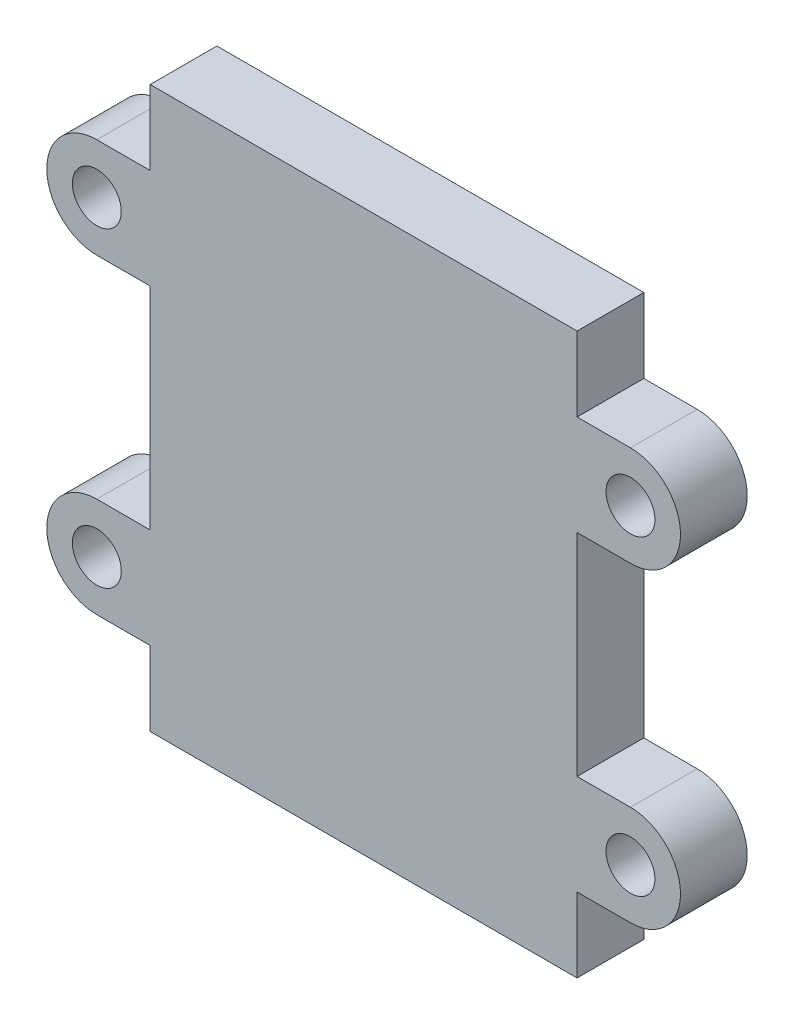
ISO-10303-21;
HEADER;
FILE_DESCRIPTION(('STEP AP214'),'2;1');
FILE_NAME('part.step','',(''),(''),'','','');
FILE_SCHEMA(('AUTOMOTIVE_DESIGN { 1 0 10303 214 1 1 1 1 }'));
ENDSEC;
DATA;
#1=APPLICATION_CONTEXT('core data for automotive mechanical design processes');
#2=APPLICATION_PROTOCOL_DEFINITION('international standard','automotive_design',2000,#1);
#3=PRODUCT_CONTEXT('',#1,'mechanical');
#4=PRODUCT('Part','Part','',(#3));
#5=PRODUCT_RELATED_PRODUCT_CATEGORY('part','',(#4));
#6=PRODUCT_DEFINITION_FORMATION('','',#4);
#7=PRODUCT_DEFINITION_CONTEXT('part definition',#1,'design');
#8=PRODUCT_DEFINITION('design','',#6,#7);
#9=PRODUCT_DEFINITION_SHAPE('','',#8);
#10=(LENGTH_UNIT() NAMED_UNIT(*) SI_UNIT(.MILLI.,.METRE.));
#11=(NAMED_UNIT(*) PLANE_ANGLE_UNIT() SI_UNIT($,.RADIAN.));
#12=(NAMED_UNIT(*) SI_UNIT($,.STERADIAN.) SOLID_ANGLE_UNIT());
#13=UNCERTAINTY_MEASURE_WITH_UNIT(LENGTH_MEASURE(1.E-05),#10,'distance_accuracy_value','');
#14=(GEOMETRIC_REPRESENTATION_CONTEXT(3) GLOBAL_UNCERTAINTY_ASSIGNED_CONTEXT((#13)) GLOBAL_UNIT_ASSIGNED_CONTEXT((#10,
#11,#12)) REPRESENTATION_CONTEXT('',''));
#15=CARTESIAN_POINT('',(0.,0.,0.));
#16=DIRECTION('',(0.,0.,1.));
#17=DIRECTION('',(1.,0.,0.));
#18=AXIS2_PLACEMENT_3D('',#15,#16,#17);
#19=CARTESIAN_POINT('',(-9.6,-12.6,3.));
#20=DIRECTION('',(1.,0.,0.));
#21=DIRECTION('',(0.,0.,-1.));
#22=AXIS2_PLACEMENT_3D('',#19,#20,#21);
#23=PLANE('',#22);
#24=DIRECTION('',(0.,-1.,0.));
#25=VECTOR('',#24,1.);
#26=CARTESIAN_POINT('',(-9.6,-12.6,0.));
#27=LINE('',#26,#25);
#28=CARTESIAN_POINT('',(-9.6,12.6,0.));
#29=VERTEX_POINT('',#28);
#30=CARTESIAN_POINT('',(-9.6,9.25,0.));
#31=VERTEX_POINT('',#30);
#32=EDGE_CURVE('E205',#29,#31,#27,.T.);
#33=ORIENTED_EDGE('',*,*,#32,.T.);
#34=DIRECTION('',(0.,0.,1.));
#35=VECTOR('',#34,1.);
#36=CARTESIAN_POINT('',(-9.6,9.25,0.));
#37=LINE('',#36,#35);
#38=CARTESIAN_POINT('',(-9.6,9.25,3.));
#39=VERTEX_POINT('',#38);
#40=EDGE_CURVE('E339',#31,#39,#37,.T.);
#41=ORIENTED_EDGE('',*,*,#40,.T.);
#42=DIRECTION('',(0.,-1.,0.));
#43=VECTOR('',#42,1.);
#44=CARTESIAN_POINT('',(-9.6,-12.6,3.));
#45=LINE('',#44,#43);
#46=CARTESIAN_POINT('',(-9.6,12.6,3.));
#47=VERTEX_POINT('',#46);
#48=EDGE_CURVE('E232',#47,#39,#45,.T.);
#49=ORIENTED_EDGE('',*,*,#48,.F.);
#50=DIRECTION('',(0.,0.,-1.));
#51=VECTOR('',#50,1.);
#52=CARTESIAN_POINT('',(-9.6,12.6,3.));
#53=LINE('',#52,#51);
#54=EDGE_CURVE('E448',#47,#29,#53,.T.);
#55=ORIENTED_EDGE('',*,*,#54,.T.);
#56=EDGE_LOOP('',(#33,#41,#49,#55));
#57=FACE_BOUND('',#56,.T.);
#58=ADVANCED_FACE('F37',(#57),#23,.F.);
#59=DIRECTION('',(0.,0.,1.));
#60=VECTOR('',#59,1.);
#61=CARTESIAN_POINT('',(-9.6,-9.25,0.));
#62=LINE('',#61,#60);
#63=CARTESIAN_POINT('',(-9.6,-9.25,0.));
#64=VERTEX_POINT('',#63);
#65=CARTESIAN_POINT('',(-9.6,-9.25,3.));
#66=VERTEX_POINT('',#65);
#67=EDGE_CURVE('E313',#64,#66,#62,.T.);
#68=ORIENTED_EDGE('',*,*,#67,.F.);
#69=CARTESIAN_POINT('',(-9.6,-12.6,0.));
#70=VERTEX_POINT('',#69);
#71=EDGE_CURVE('E208',#64,#70,#27,.T.);
#72=ORIENTED_EDGE('',*,*,#71,.T.);
#73=DIRECTION('',(0.,0.,-1.));
#74=VECTOR('',#73,1.);
#75=CARTESIAN_POINT('',(-9.6,-12.6,3.));
#76=LINE('',#75,#74);
#77=CARTESIAN_POINT('',(-9.6,-12.6,3.));
#78=VERTEX_POINT('',#77);
#79=EDGE_CURVE('E235',#78,#70,#76,.T.);
#80=ORIENTED_EDGE('',*,*,#79,.F.);
#81=EDGE_CURVE('E236',#66,#78,#45,.T.);
#82=ORIENTED_EDGE('',*,*,#81,.F.);
#83=EDGE_LOOP('',(#68,#72,#80,#82));
#84=FACE_BOUND('',#83,.T.);
#85=ADVANCED_FACE('F399',(#84),#23,.F.);
#86=CARTESIAN_POINT('',(9.6,-12.6,3.));
#87=DIRECTION('',(-1.,0.,0.));
#88=DIRECTION('',(0.,0.,1.));
#89=AXIS2_PLACEMENT_3D('',#86,#87,#88);
#90=PLANE('',#89);
#91=DIRECTION('',(0.,1.,0.));
#92=VECTOR('',#91,1.);
#93=CARTESIAN_POINT('',(9.6,-12.6,0.));
#94=LINE('',#93,#92);
#95=CARTESIAN_POINT('',(9.6,-12.6,0.));
#96=VERTEX_POINT('',#95);
#97=CARTESIAN_POINT('',(9.6,-9.25,0.));
#98=VERTEX_POINT('',#97);
#99=EDGE_CURVE('E218',#96,#98,#94,.T.);
#100=ORIENTED_EDGE('',*,*,#99,.T.);
#101=DIRECTION('',(0.,0.,1.));
#102=VECTOR('',#101,1.);
#103=CARTESIAN_POINT('',(9.6,-9.25,0.));
#104=LINE('',#103,#102);
#105=CARTESIAN_POINT('',(9.6,-9.25,3.));
#106=VERTEX_POINT('',#105);
#107=EDGE_CURVE('E275',#98,#106,#104,.T.);
#108=ORIENTED_EDGE('',*,*,#107,.T.);
#109=DIRECTION('',(0.,1.,0.));
#110=VECTOR('',#109,1.);
#111=CARTESIAN_POINT('',(9.6,-12.6,3.));
#112=LINE('',#111,#110);
#113=CARTESIAN_POINT('',(9.6,-12.6,3.));
#114=VERTEX_POINT('',#113);
#115=EDGE_CURVE('E239',#114,#106,#112,.T.);
#116=ORIENTED_EDGE('',*,*,#115,.F.);
#117=DIRECTION('',(0.,0.,-1.));
#118=VECTOR('',#117,1.);
#119=CARTESIAN_POINT('',(9.6,-12.6,3.));
#120=LINE('',#119,#118);
#121=EDGE_CURVE('E447',#114,#96,#120,.T.);
#122=ORIENTED_EDGE('',*,*,#121,.T.);
#123=EDGE_LOOP('',(#100,#108,#116,#122));
#124=FACE_BOUND('',#123,.T.);
#125=ADVANCED_FACE('F404',(#124),#90,.F.);
#126=DIRECTION('',(0.,0.,1.));
#127=VECTOR('',#126,1.);
#128=CARTESIAN_POINT('',(9.6,9.25,0.));
#129=LINE('',#128,#127);
#130=CARTESIAN_POINT('',(9.6,9.25,0.));
#131=VERTEX_POINT('',#130);
#132=CARTESIAN_POINT('',(9.6,9.25,3.));
#133=VERTEX_POINT('',#132);
#134=EDGE_CURVE('E248',#131,#133,#129,.T.);
#135=ORIENTED_EDGE('',*,*,#134,.F.);
#136=CARTESIAN_POINT('',(9.6,12.6,0.));
#137=VERTEX_POINT('',#136);
#138=EDGE_CURVE('E226',#131,#137,#94,.T.);
#139=ORIENTED_EDGE('',*,*,#138,.T.);
#140=DIRECTION('',(0.,0.,-1.));
#141=VECTOR('',#140,1.);
#142=CARTESIAN_POINT('',(9.6,12.6,3.));
#143=LINE('',#142,#141);
#144=CARTESIAN_POINT('',(9.6,12.6,3.));
#145=VERTEX_POINT('',#144);
#146=EDGE_CURVE('E446',#145,#137,#143,.T.);
#147=ORIENTED_EDGE('',*,*,#146,.F.);
#148=EDGE_CURVE('E243',#133,#145,#112,.T.);
#149=ORIENTED_EDGE('',*,*,#148,.F.);
#150=EDGE_LOOP('',(#135,#139,#147,#149));
#151=FACE_BOUND('',#150,.T.);
#152=ADVANCED_FACE('F416',(#151),#90,.F.);
#153=CARTESIAN_POINT('',(-9.6,-12.6,3.));
#154=DIRECTION('',(0.,1.,0.));
#155=DIRECTION('',(0.,0.,1.));
#156=AXIS2_PLACEMENT_3D('',#153,#154,#155);
#157=PLANE('',#156);
#158=DIRECTION('',(1.,0.,0.));
#159=VECTOR('',#158,1.);
#160=CARTESIAN_POINT('',(-9.6,-12.6,0.));
#161=LINE('',#160,#159);
#162=EDGE_CURVE('E228',#70,#96,#161,.T.);
#163=ORIENTED_EDGE('',*,*,#162,.T.);
#164=ORIENTED_EDGE('',*,*,#121,.F.);
#165=DIRECTION('',(1.,0.,0.));
#166=VECTOR('',#165,1.);
#167=CARTESIAN_POINT('',(-9.6,-12.6,3.));
#168=LINE('',#167,#166);
#169=EDGE_CURVE('E209',#78,#114,#168,.T.);
#170=ORIENTED_EDGE('',*,*,#169,.F.);
#171=ORIENTED_EDGE('',*,*,#79,.T.);
#172=EDGE_LOOP('',(#163,#164,#170,#171));
#173=FACE_BOUND('',#172,.T.);
#174=ADVANCED_FACE('F39',(#173),#157,.F.);
#175=CARTESIAN_POINT('',(9.6,-4.75,3.));
#176=VERTEX_POINT('',#175);
#177=CARTESIAN_POINT('',(9.6,4.75,3.));
#178=VERTEX_POINT('',#177);
#179=EDGE_CURVE('E242',#176,#178,#112,.T.);
#180=ORIENTED_EDGE('',*,*,#179,.F.);
#181=DIRECTION('',(0.,0.,1.));
#182=VECTOR('',#181,1.);
#183=CARTESIAN_POINT('',(9.6,-4.75,0.));
#184=LINE('',#183,#182);
#185=CARTESIAN_POINT('',(9.6,-4.75,0.));
#186=VERTEX_POINT('',#185);
#187=EDGE_CURVE('E283',#186,#176,#184,.T.);
#188=ORIENTED_EDGE('',*,*,#187,.F.);
#189=CARTESIAN_POINT('',(9.6,4.75,0.));
#190=VERTEX_POINT('',#189);
#191=EDGE_CURVE('E224',#186,#190,#94,.T.);
#192=ORIENTED_EDGE('',*,*,#191,.T.);
#193=DIRECTION('',(0.,0.,1.));
#194=VECTOR('',#193,1.);
#195=CARTESIAN_POINT('',(9.6,4.75,0.));
#196=LINE('',#195,#194);
#197=EDGE_CURVE('E251',#190,#178,#196,.T.);
#198=ORIENTED_EDGE('',*,*,#197,.T.);
#199=EDGE_LOOP('',(#180,#188,#192,#198));
#200=FACE_BOUND('',#199,.T.);
#201=ADVANCED_FACE('F411',(#200),#90,.F.);
#202=CARTESIAN_POINT('',(-9.6,12.6,3.));
#203=DIRECTION('',(0.,-1.,0.));
#204=DIRECTION('',(1.,0.,0.));
#205=AXIS2_PLACEMENT_3D('',#202,#203,#204);
#206=PLANE('',#205);
#207=DIRECTION('',(-1.,0.,0.));
#208=VECTOR('',#207,1.);
#209=CARTESIAN_POINT('',(-9.6,12.6,0.));
#210=LINE('',#209,#208);
#211=EDGE_CURVE('E212',#137,#29,#210,.T.);
#212=ORIENTED_EDGE('',*,*,#211,.T.);
#213=ORIENTED_EDGE('',*,*,#54,.F.);
#214=DIRECTION('',(-1.,0.,0.));
#215=VECTOR('',#214,1.);
#216=CARTESIAN_POINT('',(-9.6,12.6,3.));
#217=LINE('',#216,#215);
#218=EDGE_CURVE('E237',#145,#47,#217,.T.);
#219=ORIENTED_EDGE('',*,*,#218,.F.);
#220=ORIENTED_EDGE('',*,*,#146,.T.);
#221=EDGE_LOOP('',(#212,#213,#219,#220));
#222=FACE_BOUND('',#221,.T.);
#223=ADVANCED_FACE('F407',(#222),#206,.F.);
#224=CARTESIAN_POINT('',(-9.6,4.75,0.));
#225=VERTEX_POINT('',#224);
#226=CARTESIAN_POINT('',(-9.6,1.15,0.));
#227=VERTEX_POINT('',#226);
#228=EDGE_CURVE('E200',#225,#227,#27,.T.);
#229=ORIENTED_EDGE('',*,*,#228,.T.);
#230=CARTESIAN_POINT('',(-9.6,0.,0.));
#231=DIRECTION('',(-1.,0.,0.));
#232=DIRECTION('',(0.,0.,1.));
#233=AXIS2_PLACEMENT_3D('',#230,#231,#232);
#234=CIRCLE('',#233,1.15);
#235=CARTESIAN_POINT('',(-9.6,-1.15,0.));
#236=VERTEX_POINT('',#235);
#237=EDGE_CURVE('E186',#236,#227,#234,.T.);
#238=ORIENTED_EDGE('',*,*,#237,.F.);
#239=CARTESIAN_POINT('',(-9.6,-4.75,0.));
#240=VERTEX_POINT('',#239);
#241=EDGE_CURVE('E206',#236,#240,#27,.T.);
#242=ORIENTED_EDGE('',*,*,#241,.T.);
#243=DIRECTION('',(0.,0.,1.));
#244=VECTOR('',#243,1.);
#245=CARTESIAN_POINT('',(-9.6,-4.75,0.));
#246=LINE('',#245,#244);
#247=CARTESIAN_POINT('',(-9.6,-4.75,3.));
#248=VERTEX_POINT('',#247);
#249=EDGE_CURVE('E316',#240,#248,#246,.T.);
#250=ORIENTED_EDGE('',*,*,#249,.T.);
#251=CARTESIAN_POINT('',(-9.6,4.75,3.));
#252=VERTEX_POINT('',#251);
#253=EDGE_CURVE('E59',#252,#248,#45,.T.);
#254=ORIENTED_EDGE('',*,*,#253,.F.);
#255=DIRECTION('',(0.,0.,1.));
#256=VECTOR('',#255,1.);
#257=CARTESIAN_POINT('',(-9.6,4.75,0.));
#258=LINE('',#257,#256);
#259=EDGE_CURVE('E203',#225,#252,#258,.T.);
#260=ORIENTED_EDGE('',*,*,#259,.F.);
#261=EDGE_LOOP('',(#229,#238,#242,#250,#254,#260));
#262=FACE_BOUND('',#261,.T.);
#263=ADVANCED_FACE('F202',(#262),#23,.F.);
#264=CARTESIAN_POINT('',(0.,0.,3.));
#265=DIRECTION('',(0.,0.,1.));
#266=DIRECTION('',(1.,0.,0.));
#267=AXIS2_PLACEMENT_3D('',#264,#265,#266);
#268=PLANE('',#267);
#269=DIRECTION('',(1.,0.,0.));
#270=VECTOR('',#269,1.);
#271=CARTESIAN_POINT('',(-12.,-9.25,3.));
#272=LINE('',#271,#270);
#273=CARTESIAN_POINT('',(-12.,-9.25,3.));
#274=VERTEX_POINT('',#273);
#275=EDGE_CURVE('E323',#274,#66,#272,.T.);
#276=ORIENTED_EDGE('',*,*,#275,.T.);
#277=ORIENTED_EDGE('',*,*,#81,.T.);
#278=ORIENTED_EDGE('',*,*,#169,.T.);
#279=ORIENTED_EDGE('',*,*,#115,.T.);
#280=DIRECTION('',(1.,0.,0.));
#281=VECTOR('',#280,1.);
#282=CARTESIAN_POINT('',(12.,-9.25,3.));
#283=LINE('',#282,#281);
#284=CARTESIAN_POINT('',(12.,-9.25,3.));
#285=VERTEX_POINT('',#284);
#286=EDGE_CURVE('E294',#106,#285,#283,.T.);
#287=ORIENTED_EDGE('',*,*,#286,.T.);
#288=CARTESIAN_POINT('',(12.,-7.,3.));
#289=DIRECTION('',(0.,0.,1.));
#290=DIRECTION('',(1.,0.,0.));
#291=AXIS2_PLACEMENT_3D('',#288,#289,#290);
#292=CIRCLE('',#291,2.25);
#293=CARTESIAN_POINT('',(12.,-4.75,3.));
#294=VERTEX_POINT('',#293);
#295=EDGE_CURVE('E291',#285,#294,#292,.T.);
#296=ORIENTED_EDGE('',*,*,#295,.T.);
#297=DIRECTION('',(-1.,0.,0.));
#298=VECTOR('',#297,1.);
#299=CARTESIAN_POINT('',(9.6,-4.75,3.));
#300=LINE('',#299,#298);
#301=EDGE_CURVE('E287',#294,#176,#300,.T.);
#302=ORIENTED_EDGE('',*,*,#301,.T.);
#303=ORIENTED_EDGE('',*,*,#179,.T.);
#304=DIRECTION('',(1.,0.,0.));
#305=VECTOR('',#304,1.);
#306=CARTESIAN_POINT('',(9.6,4.75,3.));
#307=LINE('',#306,#305);
#308=CARTESIAN_POINT('',(12.,4.75,3.));
#309=VERTEX_POINT('',#308);
#310=EDGE_CURVE('E255',#178,#309,#307,.T.);
#311=ORIENTED_EDGE('',*,*,#310,.T.);
#312=CARTESIAN_POINT('',(12.,7.,3.));
#313=DIRECTION('',(0.,0.,1.));
#314=DIRECTION('',(-1.,0.,0.));
#315=AXIS2_PLACEMENT_3D('',#312,#313,#314);
#316=CIRCLE('',#315,2.25);
#317=CARTESIAN_POINT('',(12.,9.25,3.));
#318=VERTEX_POINT('',#317);
#319=EDGE_CURVE('E262',#309,#318,#316,.T.);
#320=ORIENTED_EDGE('',*,*,#319,.T.);
#321=DIRECTION('',(-1.,0.,0.));
#322=VECTOR('',#321,1.);
#323=CARTESIAN_POINT('',(12.,9.25,3.));
#324=LINE('',#323,#322);
#325=EDGE_CURVE('E259',#318,#133,#324,.T.);
#326=ORIENTED_EDGE('',*,*,#325,.T.);
#327=ORIENTED_EDGE('',*,*,#148,.T.);
#328=ORIENTED_EDGE('',*,*,#218,.T.);
#329=ORIENTED_EDGE('',*,*,#48,.T.);
#330=DIRECTION('',(-1.,0.,0.));
#331=VECTOR('',#330,1.);
#332=CARTESIAN_POINT('',(-12.,9.25,3.));
#333=LINE('',#332,#331);
#334=CARTESIAN_POINT('',(-12.,9.25,3.));
#335=VERTEX_POINT('',#334);
#336=EDGE_CURVE('E356',#39,#335,#333,.T.);
#337=ORIENTED_EDGE('',*,*,#336,.T.);
#338=CARTESIAN_POINT('',(-12.,7.,3.));
#339=DIRECTION('',(0.,0.,1.));
#340=DIRECTION('',(1.,0.,0.));
#341=AXIS2_PLACEMENT_3D('',#338,#339,#340);
#342=CIRCLE('',#341,2.25);
#343=CARTESIAN_POINT('',(-12.,4.75,3.));
#344=VERTEX_POINT('',#343);
#345=EDGE_CURVE('E353',#335,#344,#342,.T.);
#346=ORIENTED_EDGE('',*,*,#345,.T.);
#347=DIRECTION('',(1.,0.,0.));
#348=VECTOR('',#347,1.);
#349=CARTESIAN_POINT('',(-9.6,4.75,3.));
#350=LINE('',#349,#348);
#351=EDGE_CURVE('E349',#344,#252,#350,.T.);
#352=ORIENTED_EDGE('',*,*,#351,.T.);
#353=ORIENTED_EDGE('',*,*,#253,.T.);
#354=DIRECTION('',(-1.,0.,0.));
#355=VECTOR('',#354,1.);
#356=CARTESIAN_POINT('',(-9.6,-4.75,3.));
#357=LINE('',#356,#355);
#358=CARTESIAN_POINT('',(-12.,-4.75,3.));
#359=VERTEX_POINT('',#358);
#360=EDGE_CURVE('E319',#248,#359,#357,.T.);
#361=ORIENTED_EDGE('',*,*,#360,.T.);
#362=CARTESIAN_POINT('',(-12.,-7.,3.));
#363=DIRECTION('',(0.,0.,1.));
#364=DIRECTION('',(-1.,0.,0.));
#365=AXIS2_PLACEMENT_3D('',#362,#363,#364);
#366=CIRCLE('',#365,2.25);
#367=EDGE_CURVE('E326',#359,#274,#366,.T.);
#368=ORIENTED_EDGE('',*,*,#367,.T.);
#369=EDGE_LOOP('',(#276,#277,#278,#279,#287,#296,#302,#303,#311,#320,#326,#327,#328,#329,#337,
#346,#352,#353,#361,#368));
#370=FACE_BOUND('',#369,.T.);
#371=CARTESIAN_POINT('',(-12.,-7.,3.));
#372=DIRECTION('',(0.,0.,1.));
#373=DIRECTION('',(1.,0.,0.));
#374=AXIS2_PLACEMENT_3D('',#371,#372,#373);
#375=CIRCLE('',#374,1.1);
#376=CARTESIAN_POINT('',(-10.9,-7.,3.));
#377=VERTEX_POINT('',#376);
#378=EDGE_CURVE('E336',#377,#377,#375,.T.);
#379=ORIENTED_EDGE('',*,*,#378,.F.);
#380=EDGE_LOOP('',(#379));
#381=FACE_BOUND('',#380,.T.);
#382=CARTESIAN_POINT('',(12.,7.,3.));
#383=DIRECTION('',(0.,0.,1.));
#384=DIRECTION('',(1.,0.,0.));
#385=AXIS2_PLACEMENT_3D('',#382,#383,#384);
#386=CIRCLE('',#385,1.1);
#387=CARTESIAN_POINT('',(13.1,7.,3.));
#388=VERTEX_POINT('',#387);
#389=EDGE_CURVE('E272',#388,#388,#386,.T.);
#390=ORIENTED_EDGE('',*,*,#389,.F.);
#391=EDGE_LOOP('',(#390));
#392=FACE_BOUND('',#391,.T.);
#393=CARTESIAN_POINT('',(12.,-7.,3.));
#394=DIRECTION('',(0.,0.,1.));
#395=DIRECTION('',(-1.,0.,0.));
#396=AXIS2_PLACEMENT_3D('',#393,#394,#395);
#397=CIRCLE('',#396,1.1);
#398=CARTESIAN_POINT('',(10.9,-7.,3.));
#399=VERTEX_POINT('',#398);
#400=EDGE_CURVE('E305',#399,#399,#397,.T.);
#401=ORIENTED_EDGE('',*,*,#400,.F.);
#402=EDGE_LOOP('',(#401));
#403=FACE_BOUND('',#402,.T.);
#404=CARTESIAN_POINT('',(-12.,7.,3.));
#405=DIRECTION('',(0.,0.,1.));
#406=DIRECTION('',(-1.,0.,0.));
#407=AXIS2_PLACEMENT_3D('',#404,#405,#406);
#408=CIRCLE('',#407,1.1);
#409=CARTESIAN_POINT('',(-13.1,7.,3.));
#410=VERTEX_POINT('',#409);
#411=EDGE_CURVE('E366',#410,#410,#408,.T.);
#412=ORIENTED_EDGE('',*,*,#411,.F.);
#413=EDGE_LOOP('',(#412));
#414=FACE_BOUND('',#413,.T.);
#415=ADVANCED_FACE('F386',(#370,#381,#392,#403,#414),#268,.T.);
#416=CARTESIAN_POINT('',(0.,0.,0.));
#417=DIRECTION('',(0.,0.,1.));
#418=DIRECTION('',(1.,0.,0.));
#419=AXIS2_PLACEMENT_3D('',#416,#417,#418);
#420=PLANE('',#419);
#421=CARTESIAN_POINT('',(0.,0.,0.));
#422=DIRECTION('',(0.,0.,1.));
#423=DIRECTION('',(1.,0.,0.));
#424=AXIS2_PLACEMENT_3D('',#421,#422,#423);
#425=CIRCLE('',#424,2.5);
#426=CARTESIAN_POINT('',(2.5,0.,0.));
#427=VERTEX_POINT('',#426);
#428=EDGE_CURVE('E11',#427,#427,#425,.F.);
#429=ORIENTED_EDGE('',*,*,#428,.F.);
#430=EDGE_LOOP('',(#429));
#431=FACE_BOUND('',#430,.T.);
#432=DIRECTION('',(0.,-1.,0.));
#433=VECTOR('',#432,1.);
#434=CARTESIAN_POINT('',(-2.6,0.,0.));
#435=LINE('',#434,#433);
#436=CARTESIAN_POINT('',(-2.6,1.15,0.));
#437=VERTEX_POINT('',#436);
#438=CARTESIAN_POINT('',(-2.6,-1.15,0.));
#439=VERTEX_POINT('',#438);
#440=EDGE_CURVE('E201',#437,#439,#435,.T.);
#441=ORIENTED_EDGE('',*,*,#440,.F.);
#442=DIRECTION('',(-1.,0.,0.));
#443=VECTOR('',#442,1.);
#444=CARTESIAN_POINT('',(-2.6,1.15,0.));
#445=LINE('',#444,#443);
#446=EDGE_CURVE('E45',#437,#227,#445,.T.);
#447=ORIENTED_EDGE('',*,*,#446,.T.);
#448=ORIENTED_EDGE('',*,*,#228,.F.);
#449=DIRECTION('',(1.,0.,0.));
#450=VECTOR('',#449,1.);
#451=CARTESIAN_POINT('',(-9.6,4.75,0.));
#452=LINE('',#451,#450);
#453=CARTESIAN_POINT('',(-12.,4.75,0.));
#454=VERTEX_POINT('',#453);
#455=EDGE_CURVE('E345',#454,#225,#452,.T.);
#456=ORIENTED_EDGE('',*,*,#455,.F.);
#457=CARTESIAN_POINT('',(-12.,7.,0.));
#458=DIRECTION('',(0.,0.,1.));
#459=DIRECTION('',(1.,0.,0.));
#460=AXIS2_PLACEMENT_3D('',#457,#458,#459);
#461=CIRCLE('',#460,2.25);
#462=CARTESIAN_POINT('',(-12.,9.25,0.));
#463=VERTEX_POINT('',#462);
#464=EDGE_CURVE('E361',#463,#454,#461,.T.);
#465=ORIENTED_EDGE('',*,*,#464,.F.);
#466=DIRECTION('',(-1.,0.,0.));
#467=VECTOR('',#466,1.);
#468=CARTESIAN_POINT('',(-12.,9.25,0.));
#469=LINE('',#468,#467);
#470=EDGE_CURVE('E352',#31,#463,#469,.T.);
#471=ORIENTED_EDGE('',*,*,#470,.F.);
#472=ORIENTED_EDGE('',*,*,#32,.F.);
#473=ORIENTED_EDGE('',*,*,#211,.F.);
#474=ORIENTED_EDGE('',*,*,#138,.F.);
#475=DIRECTION('',(-1.,0.,0.));
#476=VECTOR('',#475,1.);
#477=CARTESIAN_POINT('',(12.,9.25,0.));
#478=LINE('',#477,#476);
#479=CARTESIAN_POINT('',(12.,9.25,0.));
#480=VERTEX_POINT('',#479);
#481=EDGE_CURVE('E268',#480,#131,#478,.T.);
#482=ORIENTED_EDGE('',*,*,#481,.F.);
#483=CARTESIAN_POINT('',(12.,7.,0.));
#484=DIRECTION('',(0.,0.,1.));
#485=DIRECTION('',(-1.,0.,0.));
#486=AXIS2_PLACEMENT_3D('',#483,#484,#485);
#487=CIRCLE('',#486,2.25);
#488=CARTESIAN_POINT('',(12.,4.75,0.));
#489=VERTEX_POINT('',#488);
#490=EDGE_CURVE('E258',#489,#480,#487,.T.);
#491=ORIENTED_EDGE('',*,*,#490,.F.);
#492=DIRECTION('',(1.,0.,0.));
#493=VECTOR('',#492,1.);
#494=CARTESIAN_POINT('',(9.6,4.75,0.));
#495=LINE('',#494,#493);
#496=EDGE_CURVE('E249',#190,#489,#495,.T.);
#497=ORIENTED_EDGE('',*,*,#496,.F.);
#498=ORIENTED_EDGE('',*,*,#191,.F.);
#499=DIRECTION('',(-1.,0.,0.));
#500=VECTOR('',#499,1.);
#501=CARTESIAN_POINT('',(9.6,-4.75,0.));
#502=LINE('',#501,#500);
#503=CARTESIAN_POINT('',(12.,-4.75,0.));
#504=VERTEX_POINT('',#503);
#505=EDGE_CURVE('E281',#504,#186,#502,.T.);
#506=ORIENTED_EDGE('',*,*,#505,.F.);
#507=CARTESIAN_POINT('',(12.,-7.,0.));
#508=DIRECTION('',(0.,0.,1.));
#509=DIRECTION('',(1.,0.,0.));
#510=AXIS2_PLACEMENT_3D('',#507,#508,#509);
#511=CIRCLE('',#510,2.25);
#512=CARTESIAN_POINT('',(12.,-9.25,0.));
#513=VERTEX_POINT('',#512);
#514=EDGE_CURVE('E300',#513,#504,#511,.T.);
#515=ORIENTED_EDGE('',*,*,#514,.F.);
#516=DIRECTION('',(1.,0.,0.));
#517=VECTOR('',#516,1.);
#518=CARTESIAN_POINT('',(12.,-9.25,0.));
#519=LINE('',#518,#517);
#520=EDGE_CURVE('E290',#98,#513,#519,.T.);
#521=ORIENTED_EDGE('',*,*,#520,.F.);
#522=ORIENTED_EDGE('',*,*,#99,.F.);
#523=ORIENTED_EDGE('',*,*,#162,.F.);
#524=ORIENTED_EDGE('',*,*,#71,.F.);
#525=DIRECTION('',(1.,0.,0.));
#526=VECTOR('',#525,1.);
#527=CARTESIAN_POINT('',(-12.,-9.25,0.));
#528=LINE('',#527,#526);
#529=CARTESIAN_POINT('',(-12.,-9.25,0.));
#530=VERTEX_POINT('',#529);
#531=EDGE_CURVE('E332',#530,#64,#528,.T.);
#532=ORIENTED_EDGE('',*,*,#531,.F.);
#533=CARTESIAN_POINT('',(-12.,-7.,0.));
#534=DIRECTION('',(0.,0.,1.));
#535=DIRECTION('',(-1.,0.,0.));
#536=AXIS2_PLACEMENT_3D('',#533,#534,#535);
#537=CIRCLE('',#536,2.25);
#538=CARTESIAN_POINT('',(-12.,-4.75,0.));
#539=VERTEX_POINT('',#538);
#540=EDGE_CURVE('E322',#539,#530,#537,.T.);
#541=ORIENTED_EDGE('',*,*,#540,.F.);
#542=DIRECTION('',(-1.,0.,0.));
#543=VECTOR('',#542,1.);
#544=CARTESIAN_POINT('',(-9.6,-4.75,0.));
#545=LINE('',#544,#543);
#546=EDGE_CURVE('E314',#240,#539,#545,.T.);
#547=ORIENTED_EDGE('',*,*,#546,.F.);
#548=ORIENTED_EDGE('',*,*,#241,.F.);
#549=DIRECTION('',(-1.,0.,0.));
#550=VECTOR('',#549,1.);
#551=CARTESIAN_POINT('',(-2.6,-1.15,0.));
#552=LINE('',#551,#550);
#553=EDGE_CURVE('E191',#236,#439,#552,.F.);
#554=ORIENTED_EDGE('',*,*,#553,.T.);
#555=EDGE_LOOP('',(#441,#447,#448,#456,#465,#471,#472,#473,#474,#482,#491,#497,#498,#506,#515,
#521,#522,#523,#524,#532,#541,#547,#548,#554));
#556=FACE_BOUND('',#555,.T.);
#557=CARTESIAN_POINT('',(-12.,-7.,0.));
#558=DIRECTION('',(0.,0.,1.));
#559=DIRECTION('',(1.,0.,0.));
#560=AXIS2_PLACEMENT_3D('',#557,#558,#559);
#561=CIRCLE('',#560,1.1);
#562=CARTESIAN_POINT('',(-10.9,-7.,0.));
#563=VERTEX_POINT('',#562);
#564=EDGE_CURVE('E329',#563,#563,#561,.T.);
#565=ORIENTED_EDGE('',*,*,#564,.T.);
#566=EDGE_LOOP('',(#565));
#567=FACE_BOUND('',#566,.T.);
#568=CARTESIAN_POINT('',(12.,7.,0.));
#569=DIRECTION('',(0.,0.,1.));
#570=DIRECTION('',(1.,0.,0.));
#571=AXIS2_PLACEMENT_3D('',#568,#569,#570);
#572=CIRCLE('',#571,1.1);
#573=CARTESIAN_POINT('',(13.1,7.,0.));
#574=VERTEX_POINT('',#573);
#575=EDGE_CURVE('E265',#574,#574,#572,.T.);
#576=ORIENTED_EDGE('',*,*,#575,.T.);
#577=EDGE_LOOP('',(#576));
#578=FACE_BOUND('',#577,.T.);
#579=CARTESIAN_POINT('',(12.,-7.,0.));
#580=DIRECTION('',(0.,0.,1.));
#581=DIRECTION('',(-1.,0.,0.));
#582=AXIS2_PLACEMENT_3D('',#579,#580,#581);
#583=CIRCLE('',#582,1.1);
#584=CARTESIAN_POINT('',(10.9,-7.,0.));
#585=VERTEX_POINT('',#584);
#586=EDGE_CURVE('E297',#585,#585,#583,.T.);
#587=ORIENTED_EDGE('',*,*,#586,.T.);
#588=EDGE_LOOP('',(#587));
#589=FACE_BOUND('',#588,.T.);
#590=CARTESIAN_POINT('',(-12.,7.,0.));
#591=DIRECTION('',(0.,0.,1.));
#592=DIRECTION('',(-1.,0.,0.));
#593=AXIS2_PLACEMENT_3D('',#590,#591,#592);
#594=CIRCLE('',#593,1.1);
#595=CARTESIAN_POINT('',(-13.1,7.,0.));
#596=VERTEX_POINT('',#595);
#597=EDGE_CURVE('E359',#596,#596,#594,.T.);
#598=ORIENTED_EDGE('',*,*,#597,.T.);
#599=EDGE_LOOP('',(#598));
#600=FACE_BOUND('',#599,.T.);
#601=ADVANCED_FACE('F197',(#431,#556,#567,#578,#589,#600),#420,.F.);
#602=CARTESIAN_POINT('',(12.,7.,0.));
#603=DIRECTION('',(0.,0.,1.));
#604=DIRECTION('',(1.,0.,0.));
#605=AXIS2_PLACEMENT_3D('',#602,#603,#604);
#606=CYLINDRICAL_SURFACE('',#605,2.25);
#607=ORIENTED_EDGE('',*,*,#319,.F.);
#608=DIRECTION('',(0.,0.,1.));
#609=VECTOR('',#608,1.);
#610=CARTESIAN_POINT('',(12.,4.75,0.));
#611=LINE('',#610,#609);
#612=EDGE_CURVE('E231',#489,#309,#611,.T.);
#613=ORIENTED_EDGE('',*,*,#612,.F.);
#614=ORIENTED_EDGE('',*,*,#490,.T.);
#615=DIRECTION('',(0.,0.,1.));
#616=VECTOR('',#615,1.);
#617=CARTESIAN_POINT('',(12.,9.25,0.));
#618=LINE('',#617,#616);
#619=EDGE_CURVE('E246',#480,#318,#618,.T.);
#620=ORIENTED_EDGE('',*,*,#619,.T.);
#621=EDGE_LOOP('',(#607,#613,#614,#620));
#622=FACE_BOUND('',#621,.T.);
#623=ADVANCED_FACE('F385',(#622),#606,.T.);
#624=CARTESIAN_POINT('',(9.6,4.75,0.));
#625=DIRECTION('',(0.,-1.,0.));
#626=DIRECTION('',(0.,0.,-1.));
#627=AXIS2_PLACEMENT_3D('',#624,#625,#626);
#628=PLANE('',#627);
#629=ORIENTED_EDGE('',*,*,#310,.F.);
#630=ORIENTED_EDGE('',*,*,#197,.F.);
#631=ORIENTED_EDGE('',*,*,#496,.T.);
#632=ORIENTED_EDGE('',*,*,#612,.T.);
#633=EDGE_LOOP('',(#629,#630,#631,#632));
#634=FACE_BOUND('',#633,.T.);
#635=ADVANCED_FACE('F392',(#634),#628,.T.);
#636=CARTESIAN_POINT('',(12.,9.25,0.));
#637=DIRECTION('',(0.,1.,0.));
#638=DIRECTION('',(0.,0.,1.));
#639=AXIS2_PLACEMENT_3D('',#636,#637,#638);
#640=PLANE('',#639);
#641=ORIENTED_EDGE('',*,*,#325,.F.);
#642=ORIENTED_EDGE('',*,*,#619,.F.);
#643=ORIENTED_EDGE('',*,*,#481,.T.);
#644=ORIENTED_EDGE('',*,*,#134,.T.);
#645=EDGE_LOOP('',(#641,#642,#643,#644));
#646=FACE_BOUND('',#645,.T.);
#647=ADVANCED_FACE('F512',(#646),#640,.T.);
#648=CARTESIAN_POINT('',(12.,7.,0.));
#649=DIRECTION('',(0.,0.,1.));
#650=DIRECTION('',(1.,0.,0.));
#651=AXIS2_PLACEMENT_3D('',#648,#649,#650);
#652=CYLINDRICAL_SURFACE('',#651,1.1);
#653=ORIENTED_EDGE('',*,*,#575,.F.);
#654=EDGE_LOOP('',(#653));
#655=FACE_BOUND('',#654,.T.);
#656=ORIENTED_EDGE('',*,*,#389,.T.);
#657=EDGE_LOOP('',(#656));
#658=FACE_BOUND('',#657,.T.);
#659=ADVANCED_FACE('F508',(#655,#658),#652,.F.);
#660=CARTESIAN_POINT('',(12.,-9.25,0.));
#661=DIRECTION('',(0.,-1.,0.));
#662=DIRECTION('',(0.,0.,-1.));
#663=AXIS2_PLACEMENT_3D('',#660,#661,#662);
#664=PLANE('',#663);
#665=ORIENTED_EDGE('',*,*,#286,.F.);
#666=ORIENTED_EDGE('',*,*,#107,.F.);
#667=ORIENTED_EDGE('',*,*,#520,.T.);
#668=DIRECTION('',(0.,0.,1.));
#669=VECTOR('',#668,1.);
#670=CARTESIAN_POINT('',(12.,-9.25,0.));
#671=LINE('',#670,#669);
#672=EDGE_CURVE('E278',#513,#285,#671,.T.);
#673=ORIENTED_EDGE('',*,*,#672,.T.);
#674=EDGE_LOOP('',(#665,#666,#667,#673));
#675=FACE_BOUND('',#674,.T.);
#676=ADVANCED_FACE('F501',(#675),#664,.T.);
#677=CARTESIAN_POINT('',(9.6,-4.75,0.));
#678=DIRECTION('',(0.,1.,0.));
#679=DIRECTION('',(0.,0.,1.));
#680=AXIS2_PLACEMENT_3D('',#677,#678,#679);
#681=PLANE('',#680);
#682=ORIENTED_EDGE('',*,*,#301,.F.);
#683=DIRECTION('',(0.,0.,1.));
#684=VECTOR('',#683,1.);
#685=CARTESIAN_POINT('',(12.,-4.75,0.));
#686=LINE('',#685,#684);
#687=EDGE_CURVE('E280',#504,#294,#686,.T.);
#688=ORIENTED_EDGE('',*,*,#687,.F.);
#689=ORIENTED_EDGE('',*,*,#505,.T.);
#690=ORIENTED_EDGE('',*,*,#187,.T.);
#691=EDGE_LOOP('',(#682,#688,#689,#690));
#692=FACE_BOUND('',#691,.T.);
#693=ADVANCED_FACE('F498',(#692),#681,.T.);
#694=CARTESIAN_POINT('',(12.,-7.,0.));
#695=DIRECTION('',(0.,0.,1.));
#696=DIRECTION('',(1.,0.,0.));
#697=AXIS2_PLACEMENT_3D('',#694,#695,#696);
#698=CYLINDRICAL_SURFACE('',#697,2.25);
#699=ORIENTED_EDGE('',*,*,#295,.F.);
#700=ORIENTED_EDGE('',*,*,#672,.F.);
#701=ORIENTED_EDGE('',*,*,#514,.T.);
#702=ORIENTED_EDGE('',*,*,#687,.T.);
#703=EDGE_LOOP('',(#699,#700,#701,#702));
#704=FACE_BOUND('',#703,.T.);
#705=ADVANCED_FACE('F496',(#704),#698,.T.);
#706=CARTESIAN_POINT('',(12.,-7.,0.));
#707=DIRECTION('',(0.,0.,1.));
#708=DIRECTION('',(1.,0.,0.));
#709=AXIS2_PLACEMENT_3D('',#706,#707,#708);
#710=CYLINDRICAL_SURFACE('',#709,1.1);
#711=ORIENTED_EDGE('',*,*,#586,.F.);
#712=EDGE_LOOP('',(#711));
#713=FACE_BOUND('',#712,.T.);
#714=ORIENTED_EDGE('',*,*,#400,.T.);
#715=EDGE_LOOP('',(#714));
#716=FACE_BOUND('',#715,.T.);
#717=ADVANCED_FACE('F492',(#713,#716),#710,.F.);
#718=CARTESIAN_POINT('',(-12.,-7.,0.));
#719=DIRECTION('',(0.,0.,1.));
#720=DIRECTION('',(1.,0.,0.));
#721=AXIS2_PLACEMENT_3D('',#718,#719,#720);
#722=CYLINDRICAL_SURFACE('',#721,2.25);
#723=ORIENTED_EDGE('',*,*,#367,.F.);
#724=DIRECTION('',(0.,0.,1.));
#725=VECTOR('',#724,1.);
#726=CARTESIAN_POINT('',(-12.,-4.75,0.));
#727=LINE('',#726,#725);
#728=EDGE_CURVE('E308',#539,#359,#727,.T.);
#729=ORIENTED_EDGE('',*,*,#728,.F.);
#730=ORIENTED_EDGE('',*,*,#540,.T.);
#731=DIRECTION('',(0.,0.,1.));
#732=VECTOR('',#731,1.);
#733=CARTESIAN_POINT('',(-12.,-9.25,0.));
#734=LINE('',#733,#732);
#735=EDGE_CURVE('E311',#530,#274,#734,.T.);
#736=ORIENTED_EDGE('',*,*,#735,.T.);
#737=EDGE_LOOP('',(#723,#729,#730,#736));
#738=FACE_BOUND('',#737,.T.);
#739=ADVANCED_FACE('F485',(#738),#722,.T.);
#740=CARTESIAN_POINT('',(-9.6,-4.75,0.));
#741=DIRECTION('',(0.,1.,0.));
#742=DIRECTION('',(0.,0.,1.));
#743=AXIS2_PLACEMENT_3D('',#740,#741,#742);
#744=PLANE('',#743);
#745=ORIENTED_EDGE('',*,*,#360,.F.);
#746=ORIENTED_EDGE('',*,*,#249,.F.);
#747=ORIENTED_EDGE('',*,*,#546,.T.);
#748=ORIENTED_EDGE('',*,*,#728,.T.);
#749=EDGE_LOOP('',(#745,#746,#747,#748));
#750=FACE_BOUND('',#749,.T.);
#751=ADVANCED_FACE('F482',(#750),#744,.T.);
#752=CARTESIAN_POINT('',(-12.,-9.25,0.));
#753=DIRECTION('',(0.,-1.,0.));
#754=DIRECTION('',(0.,0.,-1.));
#755=AXIS2_PLACEMENT_3D('',#752,#753,#754);
#756=PLANE('',#755);
#757=ORIENTED_EDGE('',*,*,#275,.F.);
#758=ORIENTED_EDGE('',*,*,#735,.F.);
#759=ORIENTED_EDGE('',*,*,#531,.T.);
#760=ORIENTED_EDGE('',*,*,#67,.T.);
#761=EDGE_LOOP('',(#757,#758,#759,#760));
#762=FACE_BOUND('',#761,.T.);
#763=ADVANCED_FACE('F480',(#762),#756,.T.);
#764=CARTESIAN_POINT('',(-12.,-7.,0.));
#765=DIRECTION('',(0.,0.,1.));
#766=DIRECTION('',(1.,0.,0.));
#767=AXIS2_PLACEMENT_3D('',#764,#765,#766);
#768=CYLINDRICAL_SURFACE('',#767,1.1);
#769=ORIENTED_EDGE('',*,*,#564,.F.);
#770=EDGE_LOOP('',(#769));
#771=FACE_BOUND('',#770,.T.);
#772=ORIENTED_EDGE('',*,*,#378,.T.);
#773=EDGE_LOOP('',(#772));
#774=FACE_BOUND('',#773,.T.);
#775=ADVANCED_FACE('F473',(#771,#774),#768,.F.);
#776=CARTESIAN_POINT('',(-12.,9.25,0.));
#777=DIRECTION('',(0.,1.,0.));
#778=DIRECTION('',(0.,0.,1.));
#779=AXIS2_PLACEMENT_3D('',#776,#777,#778);
#780=PLANE('',#779);
#781=ORIENTED_EDGE('',*,*,#336,.F.);
#782=ORIENTED_EDGE('',*,*,#40,.F.);
#783=ORIENTED_EDGE('',*,*,#470,.T.);
#784=DIRECTION('',(0.,0.,1.));
#785=VECTOR('',#784,1.);
#786=CARTESIAN_POINT('',(-12.,9.25,0.));
#787=LINE('',#786,#785);
#788=EDGE_CURVE('E342',#463,#335,#787,.T.);
#789=ORIENTED_EDGE('',*,*,#788,.T.);
#790=EDGE_LOOP('',(#781,#782,#783,#789));
#791=FACE_BOUND('',#790,.T.);
#792=ADVANCED_FACE('F455',(#791),#780,.T.);
#793=CARTESIAN_POINT('',(-9.6,4.75,0.));
#794=DIRECTION('',(0.,-1.,0.));
#795=DIRECTION('',(0.,0.,-1.));
#796=AXIS2_PLACEMENT_3D('',#793,#794,#795);
#797=PLANE('',#796);
#798=ORIENTED_EDGE('',*,*,#351,.F.);
#799=DIRECTION('',(0.,0.,1.));
#800=VECTOR('',#799,1.);
#801=CARTESIAN_POINT('',(-12.,4.75,0.));
#802=LINE('',#801,#800);
#803=EDGE_CURVE('E344',#454,#344,#802,.T.);
#804=ORIENTED_EDGE('',*,*,#803,.F.);
#805=ORIENTED_EDGE('',*,*,#455,.T.);
#806=ORIENTED_EDGE('',*,*,#259,.T.);
#807=EDGE_LOOP('',(#798,#804,#805,#806));
#808=FACE_BOUND('',#807,.T.);
#809=ADVANCED_FACE('F464',(#808),#797,.T.);
#810=CARTESIAN_POINT('',(-12.,7.,0.));
#811=DIRECTION('',(0.,0.,1.));
#812=DIRECTION('',(1.,0.,0.));
#813=AXIS2_PLACEMENT_3D('',#810,#811,#812);
#814=CYLINDRICAL_SURFACE('',#813,2.25);
#815=ORIENTED_EDGE('',*,*,#345,.F.);
#816=ORIENTED_EDGE('',*,*,#788,.F.);
#817=ORIENTED_EDGE('',*,*,#464,.T.);
#818=ORIENTED_EDGE('',*,*,#803,.T.);
#819=EDGE_LOOP('',(#815,#816,#817,#818));
#820=FACE_BOUND('',#819,.T.);
#821=ADVANCED_FACE('F460',(#820),#814,.T.);
#822=CARTESIAN_POINT('',(-12.,7.,0.));
#823=DIRECTION('',(0.,0.,1.));
#824=DIRECTION('',(1.,0.,0.));
#825=AXIS2_PLACEMENT_3D('',#822,#823,#824);
#826=CYLINDRICAL_SURFACE('',#825,1.1);
#827=ORIENTED_EDGE('',*,*,#597,.F.);
#828=EDGE_LOOP('',(#827));
#829=FACE_BOUND('',#828,.T.);
#830=ORIENTED_EDGE('',*,*,#411,.T.);
#831=EDGE_LOOP('',(#830));
#832=FACE_BOUND('',#831,.T.);
#833=ADVANCED_FACE('F471',(#829,#832),#826,.F.);
#834=CARTESIAN_POINT('',(-2.6,0.,0.));
#835=DIRECTION('',(-1.,0.,0.));
#836=DIRECTION('',(0.,0.,1.));
#837=AXIS2_PLACEMENT_3D('',#834,#835,#836);
#838=CYLINDRICAL_SURFACE('',#837,1.15);
#839=CARTESIAN_POINT('',(-2.6,0.,0.));
#840=DIRECTION('',(-1.,0.,0.));
#841=DIRECTION('',(0.,0.,1.));
#842=AXIS2_PLACEMENT_3D('',#839,#840,#841);
#843=CIRCLE('',#842,1.15);
#844=EDGE_CURVE('E51',#439,#437,#843,.T.);
#845=ORIENTED_EDGE('',*,*,#844,.F.);
#846=ORIENTED_EDGE('',*,*,#553,.F.);
#847=ORIENTED_EDGE('',*,*,#237,.T.);
#848=ORIENTED_EDGE('',*,*,#446,.F.);
#849=EDGE_LOOP('',(#845,#846,#847,#848));
#850=FACE_BOUND('',#849,.T.);
#851=ADVANCED_FACE('F188',(#850),#838,.F.);
#852=CARTESIAN_POINT('',(-2.6,0.,0.));
#853=DIRECTION('',(-1.,0.,0.));
#854=DIRECTION('',(0.,0.,1.));
#855=AXIS2_PLACEMENT_3D('',#852,#853,#854);
#856=PLANE('',#855);
#857=ORIENTED_EDGE('',*,*,#440,.T.);
#858=ORIENTED_EDGE('',*,*,#844,.T.);
#859=EDGE_LOOP('',(#857,#858));
#860=FACE_BOUND('',#859,.T.);
#861=ADVANCED_FACE('F380',(#860),#856,.T.);
#862=CARTESIAN_POINT('',(0.,0.,-3.));
#863=DIRECTION('',(0.,0.,1.));
#864=DIRECTION('',(1.,0.,0.));
#865=AXIS2_PLACEMENT_3D('',#862,#863,#864);
#866=CYLINDRICAL_SURFACE('',#865,2.5);
#867=CARTESIAN_POINT('',(0.,0.,-3.));
#868=DIRECTION('',(0.,0.,-1.));
#869=DIRECTION('',(-1.,0.,0.));
#870=AXIS2_PLACEMENT_3D('',#867,#868,#869);
#871=CIRCLE('',#870,2.5);
#872=CARTESIAN_POINT('',(-2.5,0.,-3.));
#873=VERTEX_POINT('',#872);
#874=EDGE_CURVE('E194',#873,#873,#871,.T.);
#875=ORIENTED_EDGE('',*,*,#874,.F.);
#876=EDGE_LOOP('',(#875));
#877=FACE_BOUND('',#876,.T.);
#878=ORIENTED_EDGE('',*,*,#428,.T.);
#879=EDGE_LOOP('',(#878));
#880=FACE_BOUND('',#879,.T.);
#881=ADVANCED_FACE('F377',(#877,#880),#866,.T.);
#882=CARTESIAN_POINT('',(0.,0.,-3.));
#883=DIRECTION('',(0.,0.,-1.));
#884=DIRECTION('',(-1.,0.,0.));
#885=AXIS2_PLACEMENT_3D('',#882,#883,#884);
#886=PLANE('',#885);
#887=ORIENTED_EDGE('',*,*,#874,.T.);
#888=EDGE_LOOP('',(#887));
#889=FACE_BOUND('',#888,.T.);
#890=ADVANCED_FACE('F375',(#889),#886,.T.);
#891=CLOSED_SHELL('',(#58,#85,#125,#152,#174,#201,#223,#263,#415,#601,#623,#635,#647,#659,#676,
#693,#705,#717,#739,#751,#763,#775,#792,#809,#821,#833,#851,#861,#881,#890));
#892=MANIFOLD_SOLID_BREP('B2',#891);
#893=ADVANCED_BREP_SHAPE_REPRESENTATION('',(#18,#892),#14);
#894=SHAPE_DEFINITION_REPRESENTATION(#9,#893);
ENDSEC;
END-ISO-10303-21;
